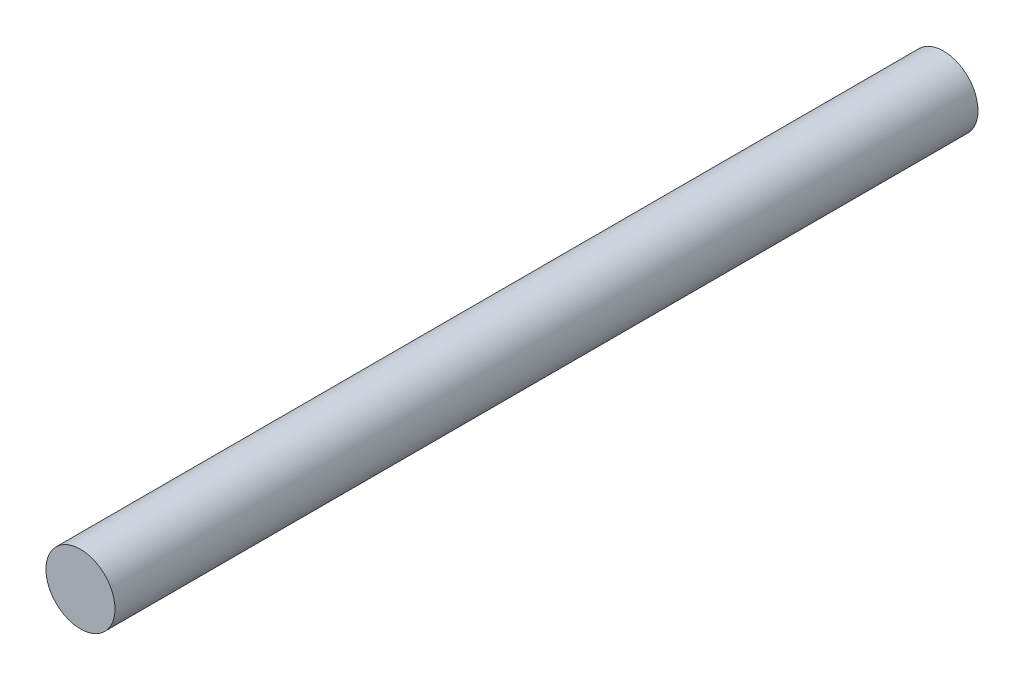
ISO-10303-21;
HEADER;
FILE_DESCRIPTION(('STEP AP214'),'2;1');
FILE_NAME('part.step','',(''),(''),'','','');
FILE_SCHEMA(('AUTOMOTIVE_DESIGN { 1 0 10303 214 1 1 1 1 }'));
ENDSEC;
DATA;
#1=APPLICATION_CONTEXT('core data for automotive mechanical design processes');
#2=APPLICATION_PROTOCOL_DEFINITION('international standard','automotive_design',2000,#1);
#3=PRODUCT_CONTEXT('',#1,'mechanical');
#4=PRODUCT('Part','Part','',(#3));
#5=PRODUCT_RELATED_PRODUCT_CATEGORY('part','',(#4));
#6=PRODUCT_DEFINITION_FORMATION('','',#4);
#7=PRODUCT_DEFINITION_CONTEXT('part definition',#1,'design');
#8=PRODUCT_DEFINITION('design','',#6,#7);
#9=PRODUCT_DEFINITION_SHAPE('','',#8);
#10=(LENGTH_UNIT() NAMED_UNIT(*) SI_UNIT(.MILLI.,.METRE.));
#11=(NAMED_UNIT(*) PLANE_ANGLE_UNIT() SI_UNIT($,.RADIAN.));
#12=(NAMED_UNIT(*) SI_UNIT($,.STERADIAN.) SOLID_ANGLE_UNIT());
#13=UNCERTAINTY_MEASURE_WITH_UNIT(LENGTH_MEASURE(1.E-05),#10,'distance_accuracy_value','');
#14=(GEOMETRIC_REPRESENTATION_CONTEXT(3) GLOBAL_UNCERTAINTY_ASSIGNED_CONTEXT((#13)) GLOBAL_UNIT_ASSIGNED_CONTEXT((#10,
#11,#12)) REPRESENTATION_CONTEXT('',''));
#15=CARTESIAN_POINT('',(0.,0.,0.));
#16=DIRECTION('',(0.,0.,1.));
#17=DIRECTION('',(1.,0.,0.));
#18=AXIS2_PLACEMENT_3D('',#15,#16,#17);
#19=CARTESIAN_POINT('',(0.,0.,250.));
#20=DIRECTION('',(0.,0.,-1.));
#21=DIRECTION('',(-1.,0.,0.));
#22=AXIS2_PLACEMENT_3D('',#19,#20,#21);
#23=CYLINDRICAL_SURFACE('',#22,10.);
#24=CARTESIAN_POINT('',(0.,0.,250.));
#25=DIRECTION('',(0.,0.,1.));
#26=DIRECTION('',(1.,0.,0.));
#27=AXIS2_PLACEMENT_3D('',#24,#25,#26);
#28=CIRCLE('',#27,10.);
#29=CARTESIAN_POINT('',(10.,0.,250.));
#30=VERTEX_POINT('',#29);
#31=EDGE_CURVE('E10',#30,#30,#28,.T.);
#32=ORIENTED_EDGE('',*,*,#31,.F.);
#33=EDGE_LOOP('',(#32));
#34=FACE_BOUND('',#33,.T.);
#35=CARTESIAN_POINT('',(0.,0.,0.));
#36=DIRECTION('',(0.,0.,1.));
#37=DIRECTION('',(1.,0.,0.));
#38=AXIS2_PLACEMENT_3D('',#35,#36,#37);
#39=CIRCLE('',#38,10.);
#40=CARTESIAN_POINT('',(10.,0.,0.));
#41=VERTEX_POINT('',#40);
#42=EDGE_CURVE('E40',#41,#41,#39,.T.);
#43=ORIENTED_EDGE('',*,*,#42,.T.);
#44=EDGE_LOOP('',(#43));
#45=FACE_BOUND('',#44,.T.);
#46=ADVANCED_FACE('F37',(#34,#45),#23,.T.);
#47=CARTESIAN_POINT('',(0.,0.,250.));
#48=DIRECTION('',(0.,0.,1.));
#49=DIRECTION('',(1.,0.,0.));
#50=AXIS2_PLACEMENT_3D('',#47,#48,#49);
#51=PLANE('',#50);
#52=ORIENTED_EDGE('',*,*,#31,.T.);
#53=EDGE_LOOP('',(#52));
#54=FACE_BOUND('',#53,.T.);
#55=ADVANCED_FACE('F54',(#54),#51,.T.);
#56=CARTESIAN_POINT('',(0.,0.,0.));
#57=DIRECTION('',(0.,0.,1.));
#58=DIRECTION('',(1.,0.,0.));
#59=AXIS2_PLACEMENT_3D('',#56,#57,#58);
#60=PLANE('',#59);
#61=ORIENTED_EDGE('',*,*,#42,.F.);
#62=EDGE_LOOP('',(#61));
#63=FACE_BOUND('',#62,.T.);
#64=ADVANCED_FACE('F52',(#63),#60,.F.);
#65=CLOSED_SHELL('',(#46,#55,#64));
#66=MANIFOLD_SOLID_BREP('B2',#65);
#67=ADVANCED_BREP_SHAPE_REPRESENTATION('',(#18,#66),#14);
#68=SHAPE_DEFINITION_REPRESENTATION(#9,#67);
ENDSEC;
END-ISO-10303-21;
